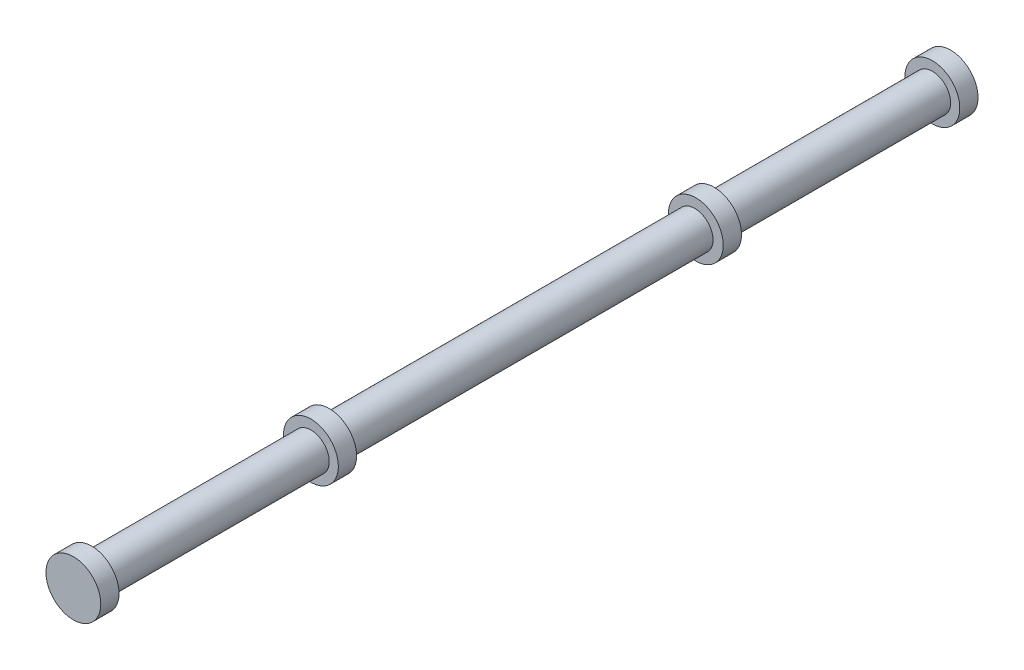
ISO-10303-21;
HEADER;
FILE_DESCRIPTION(('STEP AP214'),'2;1');
FILE_NAME('part.step','',(''),(''),'','','');
FILE_SCHEMA(('AUTOMOTIVE_DESIGN { 1 0 10303 214 1 1 1 1 }'));
ENDSEC;
DATA;
#1=APPLICATION_CONTEXT('core data for automotive mechanical design processes');
#2=APPLICATION_PROTOCOL_DEFINITION('international standard','automotive_design',2000,#1);
#3=PRODUCT_CONTEXT('',#1,'mechanical');
#4=PRODUCT('Part','Part','',(#3));
#5=PRODUCT_RELATED_PRODUCT_CATEGORY('part','',(#4));
#6=PRODUCT_DEFINITION_FORMATION('','',#4);
#7=PRODUCT_DEFINITION_CONTEXT('part definition',#1,'design');
#8=PRODUCT_DEFINITION('design','',#6,#7);
#9=PRODUCT_DEFINITION_SHAPE('','',#8);
#10=(LENGTH_UNIT() NAMED_UNIT(*) SI_UNIT(.MILLI.,.METRE.));
#11=(NAMED_UNIT(*) PLANE_ANGLE_UNIT() SI_UNIT($,.RADIAN.));
#12=(NAMED_UNIT(*) SI_UNIT($,.STERADIAN.) SOLID_ANGLE_UNIT());
#13=UNCERTAINTY_MEASURE_WITH_UNIT(LENGTH_MEASURE(1.E-05),#10,'distance_accuracy_value','');
#14=(GEOMETRIC_REPRESENTATION_CONTEXT(3) GLOBAL_UNCERTAINTY_ASSIGNED_CONTEXT((#13)) GLOBAL_UNIT_ASSIGNED_CONTEXT((#10,
#11,#12)) REPRESENTATION_CONTEXT('',''));
#15=CARTESIAN_POINT('',(0.,0.,0.));
#16=DIRECTION('',(0.,0.,1.));
#17=DIRECTION('',(1.,0.,0.));
#18=AXIS2_PLACEMENT_3D('',#15,#16,#17);
#19=CARTESIAN_POINT('',(0.,0.,230.));
#20=DIRECTION('',(0.,0.,-1.));
#21=DIRECTION('',(-1.,0.,0.));
#22=AXIS2_PLACEMENT_3D('',#19,#20,#21);
#23=CYLINDRICAL_SURFACE('',#22,5.);
#24=CARTESIAN_POINT('',(0.,0.,0.));
#25=DIRECTION('',(0.,0.,-1.));
#26=DIRECTION('',(-1.,0.,0.));
#27=AXIS2_PLACEMENT_3D('',#24,#25,#26);
#28=CIRCLE('',#27,5.);
#29=CARTESIAN_POINT('',(-5.,0.,0.));
#30=VERTEX_POINT('',#29);
#31=EDGE_CURVE('E75',#30,#30,#28,.T.);
#32=ORIENTED_EDGE('',*,*,#31,.F.);
#33=EDGE_LOOP('',(#32));
#34=FACE_BOUND('',#33,.T.);
#35=CARTESIAN_POINT('',(0.,0.,60.));
#36=DIRECTION('',(0.,0.,1.));
#37=DIRECTION('',(0.,-1.,0.));
#38=AXIS2_PLACEMENT_3D('',#35,#36,#37);
#39=CIRCLE('',#38,5.);
#40=CARTESIAN_POINT('',(0.,-5.,60.));
#41=VERTEX_POINT('',#40);
#42=EDGE_CURVE('E40',#41,#41,#39,.T.);
#43=ORIENTED_EDGE('',*,*,#42,.F.);
#44=EDGE_LOOP('',(#43));
#45=FACE_BOUND('',#44,.T.);
#46=ADVANCED_FACE('F33',(#34,#45),#23,.T.);
#47=CARTESIAN_POINT('',(0.,0.,0.));
#48=DIRECTION('',(0.,0.,-1.));
#49=DIRECTION('',(-1.,0.,0.));
#50=AXIS2_PLACEMENT_3D('',#47,#48,#49);
#51=PLANE('',#50);
#52=CARTESIAN_POINT('',(0.,0.,0.));
#53=DIRECTION('',(0.,0.,-1.));
#54=DIRECTION('',(-1.,0.,0.));
#55=AXIS2_PLACEMENT_3D('',#52,#53,#54);
#56=CIRCLE('',#55,7.5);
#57=CARTESIAN_POINT('',(-7.5,0.,0.));
#58=VERTEX_POINT('',#57);
#59=EDGE_CURVE('E76',#58,#58,#56,.T.);
#60=ORIENTED_EDGE('',*,*,#59,.F.);
#61=EDGE_LOOP('',(#60));
#62=FACE_BOUND('',#61,.T.);
#63=ORIENTED_EDGE('',*,*,#31,.T.);
#64=EDGE_LOOP('',(#63));
#65=FACE_BOUND('',#64,.T.);
#66=ADVANCED_FACE('F101',(#62,#65),#51,.F.);
#67=CARTESIAN_POINT('',(0.,0.,-5.));
#68=DIRECTION('',(0.,0.,1.));
#69=DIRECTION('',(1.,0.,0.));
#70=AXIS2_PLACEMENT_3D('',#67,#68,#69);
#71=CYLINDRICAL_SURFACE('',#70,7.5);
#72=CARTESIAN_POINT('',(0.,0.,-5.));
#73=DIRECTION('',(0.,0.,-1.));
#74=DIRECTION('',(-1.,0.,0.));
#75=AXIS2_PLACEMENT_3D('',#72,#73,#74);
#76=CIRCLE('',#75,7.5);
#77=CARTESIAN_POINT('',(-7.5,0.,-5.));
#78=VERTEX_POINT('',#77);
#79=EDGE_CURVE('E72',#78,#78,#76,.T.);
#80=ORIENTED_EDGE('',*,*,#79,.F.);
#81=EDGE_LOOP('',(#80));
#82=FACE_BOUND('',#81,.T.);
#83=ORIENTED_EDGE('',*,*,#59,.T.);
#84=EDGE_LOOP('',(#83));
#85=FACE_BOUND('',#84,.T.);
#86=ADVANCED_FACE('F134',(#82,#85),#71,.T.);
#87=CARTESIAN_POINT('',(0.,0.,-5.));
#88=DIRECTION('',(0.,0.,-1.));
#89=DIRECTION('',(-1.,0.,0.));
#90=AXIS2_PLACEMENT_3D('',#87,#88,#89);
#91=PLANE('',#90);
#92=ORIENTED_EDGE('',*,*,#79,.T.);
#93=EDGE_LOOP('',(#92));
#94=FACE_BOUND('',#93,.T.);
#95=ADVANCED_FACE('F127',(#94),#91,.T.);
#96=CARTESIAN_POINT('',(0.,0.,60.));
#97=DIRECTION('',(0.,0.,1.));
#98=DIRECTION('',(0.,-1.,0.));
#99=AXIS2_PLACEMENT_3D('',#96,#97,#98);
#100=PLANE('',#99);
#101=CARTESIAN_POINT('',(0.293746034060405,0.162052373696042,60.));
#102=DIRECTION('',(0.,0.,-1.));
#103=DIRECTION('',(-1.,0.,0.));
#104=AXIS2_PLACEMENT_3D('',#101,#102,#103);
#105=CIRCLE('',#104,7.5);
#106=CARTESIAN_POINT('',(-7.2062539659396,0.162052373696042,60.));
#107=VERTEX_POINT('',#106);
#108=EDGE_CURVE('E55',#107,#107,#105,.T.);
#109=ORIENTED_EDGE('',*,*,#108,.T.);
#110=EDGE_LOOP('',(#109));
#111=FACE_BOUND('',#110,.T.);
#112=ORIENTED_EDGE('',*,*,#42,.T.);
#113=EDGE_LOOP('',(#112));
#114=FACE_BOUND('',#113,.T.);
#115=ADVANCED_FACE('F121',(#111,#114),#100,.F.);
#116=CARTESIAN_POINT('',(0.,0.,65.));
#117=DIRECTION('',(0.,0.,1.));
#118=DIRECTION('',(0.,-1.,0.));
#119=AXIS2_PLACEMENT_3D('',#116,#117,#118);
#120=PLANE('',#119);
#121=CARTESIAN_POINT('',(0.293746034060405,0.162052373696042,65.));
#122=DIRECTION('',(0.,0.,-1.));
#123=DIRECTION('',(-1.,0.,0.));
#124=AXIS2_PLACEMENT_3D('',#121,#122,#123);
#125=CIRCLE('',#124,7.5);
#126=CARTESIAN_POINT('',(-7.2062539659396,0.162052373696042,65.));
#127=VERTEX_POINT('',#126);
#128=EDGE_CURVE('E60',#127,#127,#125,.T.);
#129=ORIENTED_EDGE('',*,*,#128,.F.);
#130=EDGE_LOOP('',(#129));
#131=FACE_BOUND('',#130,.T.);
#132=CARTESIAN_POINT('',(0.,0.,65.));
#133=DIRECTION('',(0.,0.,1.));
#134=DIRECTION('',(0.,-1.,0.));
#135=AXIS2_PLACEMENT_3D('',#132,#133,#134);
#136=CIRCLE('',#135,5.);
#137=CARTESIAN_POINT('',(0.,-5.,65.));
#138=VERTEX_POINT('',#137);
#139=EDGE_CURVE('E52',#138,#138,#136,.T.);
#140=ORIENTED_EDGE('',*,*,#139,.F.);
#141=EDGE_LOOP('',(#140));
#142=FACE_BOUND('',#141,.T.);
#143=ADVANCED_FACE('F113',(#131,#142),#120,.T.);
#144=CARTESIAN_POINT('',(0.293746034060405,0.162052373696042,60.));
#145=DIRECTION('',(0.,0.,1.));
#146=DIRECTION('',(1.,0.,0.));
#147=AXIS2_PLACEMENT_3D('',#144,#145,#146);
#148=CYLINDRICAL_SURFACE('',#147,7.5);
#149=ORIENTED_EDGE('',*,*,#108,.F.);
#150=EDGE_LOOP('',(#149));
#151=FACE_BOUND('',#150,.T.);
#152=ORIENTED_EDGE('',*,*,#128,.T.);
#153=EDGE_LOOP('',(#152));
#154=FACE_BOUND('',#153,.T.);
#155=ADVANCED_FACE('F105',(#151,#154),#148,.T.);
#156=CARTESIAN_POINT('',(0.,0.,165.));
#157=DIRECTION('',(0.,0.,-1.));
#158=DIRECTION('',(-1.,0.,0.));
#159=AXIS2_PLACEMENT_3D('',#156,#157,#158);
#160=CIRCLE('',#159,5.);
#161=CARTESIAN_POINT('',(-5.,0.,165.));
#162=VERTEX_POINT('',#161);
#163=EDGE_CURVE('E53',#162,#162,#160,.T.);
#164=ORIENTED_EDGE('',*,*,#163,.T.);
#165=EDGE_LOOP('',(#164));
#166=FACE_BOUND('',#165,.T.);
#167=ORIENTED_EDGE('',*,*,#139,.T.);
#168=EDGE_LOOP('',(#167));
#169=FACE_BOUND('',#168,.T.);
#170=ADVANCED_FACE('F35',(#166,#169),#23,.T.);
#171=CARTESIAN_POINT('',(-6.44518404357042E-13,0.,170.));
#172=DIRECTION('',(0.,0.,-1.));
#173=DIRECTION('',(-1.,0.,0.));
#174=AXIS2_PLACEMENT_3D('',#171,#172,#173);
#175=PLANE('',#174);
#176=CARTESIAN_POINT('',(-0.0147634304710209,0.0874551131886392,170.));
#177=DIRECTION('',(0.,0.,-1.));
#178=DIRECTION('',(-1.,0.,0.));
#179=AXIS2_PLACEMENT_3D('',#176,#177,#178);
#180=CIRCLE('',#179,7.5);
#181=CARTESIAN_POINT('',(-7.51476343047102,0.0874551131886392,170.));
#182=VERTEX_POINT('',#181);
#183=EDGE_CURVE('E63',#182,#182,#180,.T.);
#184=ORIENTED_EDGE('',*,*,#183,.F.);
#185=EDGE_LOOP('',(#184));
#186=FACE_BOUND('',#185,.T.);
#187=CARTESIAN_POINT('',(0.,0.,170.));
#188=DIRECTION('',(0.,0.,-1.));
#189=DIRECTION('',(-1.,0.,0.));
#190=AXIS2_PLACEMENT_3D('',#187,#188,#189);
#191=CIRCLE('',#190,5.);
#192=CARTESIAN_POINT('',(-5.,0.,170.));
#193=VERTEX_POINT('',#192);
#194=EDGE_CURVE('E11',#193,#193,#191,.T.);
#195=ORIENTED_EDGE('',*,*,#194,.T.);
#196=EDGE_LOOP('',(#195));
#197=FACE_BOUND('',#196,.T.);
#198=ADVANCED_FACE('F104',(#186,#197),#175,.F.);
#199=CARTESIAN_POINT('',(-6.44518404357042E-13,0.,165.));
#200=DIRECTION('',(0.,0.,-1.));
#201=DIRECTION('',(-1.,0.,0.));
#202=AXIS2_PLACEMENT_3D('',#199,#200,#201);
#203=PLANE('',#202);
#204=CARTESIAN_POINT('',(-0.0147634304710209,0.0874551131886392,165.));
#205=DIRECTION('',(0.,0.,-1.));
#206=DIRECTION('',(-1.,0.,0.));
#207=AXIS2_PLACEMENT_3D('',#204,#205,#206);
#208=CIRCLE('',#207,7.5);
#209=CARTESIAN_POINT('',(-7.51476343047102,0.0874551131886392,165.));
#210=VERTEX_POINT('',#209);
#211=EDGE_CURVE('E56',#210,#210,#208,.T.);
#212=ORIENTED_EDGE('',*,*,#211,.T.);
#213=EDGE_LOOP('',(#212));
#214=FACE_BOUND('',#213,.T.);
#215=ORIENTED_EDGE('',*,*,#163,.F.);
#216=EDGE_LOOP('',(#215));
#217=FACE_BOUND('',#216,.T.);
#218=ADVANCED_FACE('F110',(#214,#217),#203,.T.);
#219=CARTESIAN_POINT('',(-0.0147634304710209,0.0874551131886392,170.));
#220=DIRECTION('',(0.,0.,-1.));
#221=DIRECTION('',(-1.,0.,0.));
#222=AXIS2_PLACEMENT_3D('',#219,#220,#221);
#223=CYLINDRICAL_SURFACE('',#222,7.5);
#224=ORIENTED_EDGE('',*,*,#183,.T.);
#225=EDGE_LOOP('',(#224));
#226=FACE_BOUND('',#225,.T.);
#227=ORIENTED_EDGE('',*,*,#211,.F.);
#228=EDGE_LOOP('',(#227));
#229=FACE_BOUND('',#228,.T.);
#230=ADVANCED_FACE('F144',(#226,#229),#223,.T.);
#231=CARTESIAN_POINT('',(0.,0.,235.));
#232=DIRECTION('',(0.,0.,1.));
#233=DIRECTION('',(1.,0.,0.));
#234=AXIS2_PLACEMENT_3D('',#231,#232,#233);
#235=PLANE('',#234);
#236=CARTESIAN_POINT('',(0.,0.,235.));
#237=DIRECTION('',(0.,0.,1.));
#238=DIRECTION('',(1.,0.,0.));
#239=AXIS2_PLACEMENT_3D('',#236,#237,#238);
#240=CIRCLE('',#239,7.5);
#241=CARTESIAN_POINT('',(7.5,0.,235.));
#242=VERTEX_POINT('',#241);
#243=EDGE_CURVE('E49',#242,#242,#240,.T.);
#244=ORIENTED_EDGE('',*,*,#243,.T.);
#245=EDGE_LOOP('',(#244));
#246=FACE_BOUND('',#245,.T.);
#247=ADVANCED_FACE('F142',(#246),#235,.T.);
#248=CARTESIAN_POINT('',(0.,0.,235.));
#249=DIRECTION('',(0.,0.,-1.));
#250=DIRECTION('',(-1.,0.,0.));
#251=AXIS2_PLACEMENT_3D('',#248,#249,#250);
#252=CYLINDRICAL_SURFACE('',#251,7.5);
#253=ORIENTED_EDGE('',*,*,#243,.F.);
#254=EDGE_LOOP('',(#253));
#255=FACE_BOUND('',#254,.T.);
#256=CARTESIAN_POINT('',(0.,0.,230.));
#257=DIRECTION('',(0.,0.,1.));
#258=DIRECTION('',(1.,0.,0.));
#259=AXIS2_PLACEMENT_3D('',#256,#257,#258);
#260=CIRCLE('',#259,7.5);
#261=CARTESIAN_POINT('',(7.5,0.,230.));
#262=VERTEX_POINT('',#261);
#263=EDGE_CURVE('E81',#262,#262,#260,.T.);
#264=ORIENTED_EDGE('',*,*,#263,.T.);
#265=EDGE_LOOP('',(#264));
#266=FACE_BOUND('',#265,.T.);
#267=ADVANCED_FACE('F87',(#255,#266),#252,.T.);
#268=CARTESIAN_POINT('',(0.,0.,230.));
#269=DIRECTION('',(0.,0.,1.));
#270=DIRECTION('',(1.,0.,0.));
#271=AXIS2_PLACEMENT_3D('',#268,#269,#270);
#272=PLANE('',#271);
#273=ORIENTED_EDGE('',*,*,#263,.F.);
#274=EDGE_LOOP('',(#273));
#275=FACE_BOUND('',#274,.T.);
#276=CARTESIAN_POINT('',(0.,0.,230.));
#277=DIRECTION('',(0.,0.,1.));
#278=DIRECTION('',(1.,0.,0.));
#279=AXIS2_PLACEMENT_3D('',#276,#277,#278);
#280=CIRCLE('',#279,5.);
#281=CARTESIAN_POINT('',(5.,0.,230.));
#282=VERTEX_POINT('',#281);
#283=EDGE_CURVE('E44',#282,#282,#280,.T.);
#284=ORIENTED_EDGE('',*,*,#283,.T.);
#285=EDGE_LOOP('',(#284));
#286=FACE_BOUND('',#285,.T.);
#287=ADVANCED_FACE('F89',(#275,#286),#272,.F.);
#288=ORIENTED_EDGE('',*,*,#283,.F.);
#289=EDGE_LOOP('',(#288));
#290=FACE_BOUND('',#289,.T.);
#291=ORIENTED_EDGE('',*,*,#194,.F.);
#292=EDGE_LOOP('',(#291));
#293=FACE_BOUND('',#292,.T.);
#294=ADVANCED_FACE('F92',(#290,#293),#23,.T.);
#295=CLOSED_SHELL('',(#46,#66,#86,#95,#115,#143,#155,#170,#198,#218,#230,#247,#267,#287,#294));
#296=MANIFOLD_SOLID_BREP('B2',#295);
#297=ADVANCED_BREP_SHAPE_REPRESENTATION('',(#18,#296),#14);
#298=SHAPE_DEFINITION_REPRESENTATION(#9,#297);
ENDSEC;
END-ISO-10303-21;
